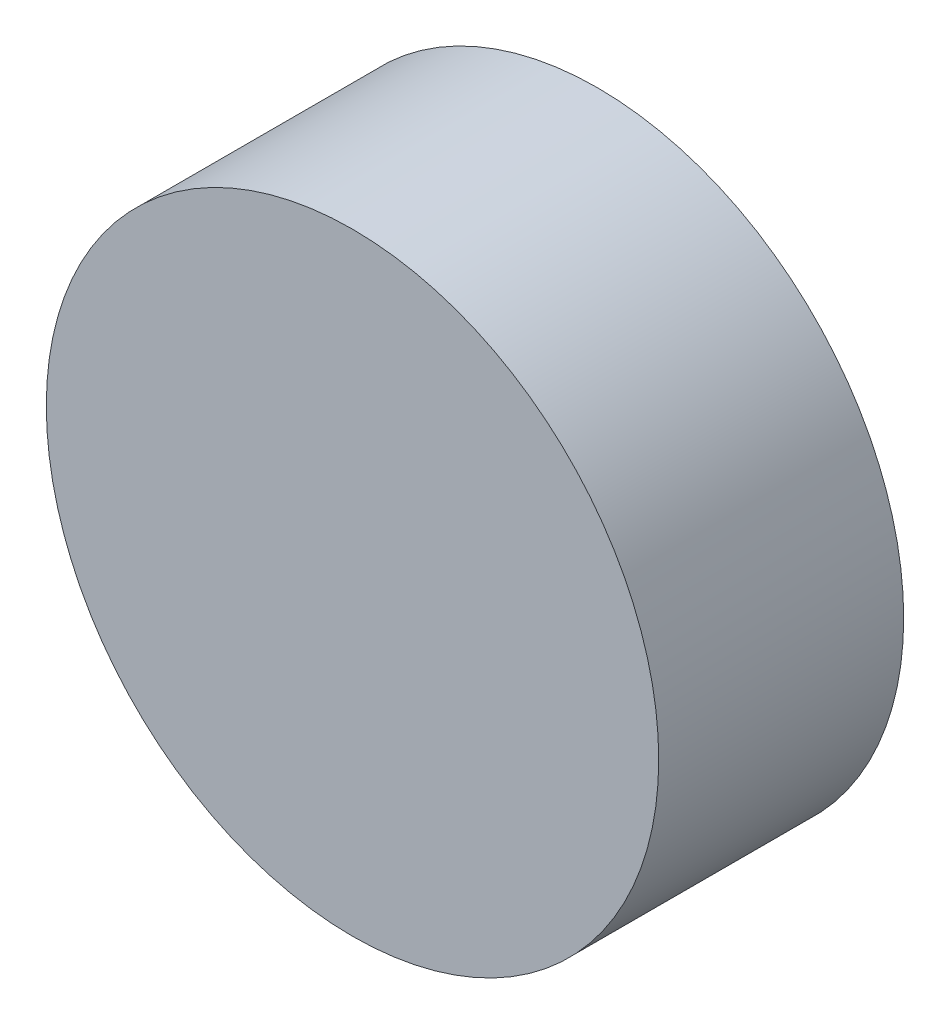
ISO-10303-21;
HEADER;
FILE_DESCRIPTION(('STEP AP214'),'2;1');
FILE_NAME('part.step','',(''),(''),'','','');
FILE_SCHEMA(('AUTOMOTIVE_DESIGN { 1 0 10303 214 1 1 1 1 }'));
ENDSEC;
DATA;
#1=APPLICATION_CONTEXT('core data for automotive mechanical design processes');
#2=APPLICATION_PROTOCOL_DEFINITION('international standard','automotive_design',2000,#1);
#3=PRODUCT_CONTEXT('',#1,'mechanical');
#4=PRODUCT('Part','Part','',(#3));
#5=PRODUCT_RELATED_PRODUCT_CATEGORY('part','',(#4));
#6=PRODUCT_DEFINITION_FORMATION('','',#4);
#7=PRODUCT_DEFINITION_CONTEXT('part definition',#1,'design');
#8=PRODUCT_DEFINITION('design','',#6,#7);
#9=PRODUCT_DEFINITION_SHAPE('','',#8);
#10=(LENGTH_UNIT() NAMED_UNIT(*) SI_UNIT(.MILLI.,.METRE.));
#11=(NAMED_UNIT(*) PLANE_ANGLE_UNIT() SI_UNIT($,.RADIAN.));
#12=(NAMED_UNIT(*) SI_UNIT($,.STERADIAN.) SOLID_ANGLE_UNIT());
#13=UNCERTAINTY_MEASURE_WITH_UNIT(LENGTH_MEASURE(1.E-05),#10,'distance_accuracy_value','');
#14=(GEOMETRIC_REPRESENTATION_CONTEXT(3) GLOBAL_UNCERTAINTY_ASSIGNED_CONTEXT((#13)) GLOBAL_UNIT_ASSIGNED_CONTEXT((#10,
#11,#12)) REPRESENTATION_CONTEXT('',''));
#15=CARTESIAN_POINT('',(0.,0.,0.));
#16=DIRECTION('',(0.,0.,1.));
#17=DIRECTION('',(1.,0.,0.));
#18=AXIS2_PLACEMENT_3D('',#15,#16,#17);
#19=CARTESIAN_POINT('',(0.,0.,1.));
#20=DIRECTION('',(0.,0.,-1.));
#21=DIRECTION('',(-1.,0.,0.));
#22=AXIS2_PLACEMENT_3D('',#19,#20,#21);
#23=CYLINDRICAL_SURFACE('',#22,2.5);
#24=CARTESIAN_POINT('',(0.,0.,1.));
#25=DIRECTION('',(0.,0.,1.));
#26=DIRECTION('',(1.,0.,0.));
#27=AXIS2_PLACEMENT_3D('',#24,#25,#26);
#28=CIRCLE('',#27,2.5);
#29=CARTESIAN_POINT('',(2.5,0.,1.));
#30=VERTEX_POINT('',#29);
#31=EDGE_CURVE('E10',#30,#30,#28,.T.);
#32=ORIENTED_EDGE('',*,*,#31,.F.);
#33=EDGE_LOOP('',(#32));
#34=FACE_BOUND('',#33,.T.);
#35=CARTESIAN_POINT('',(0.,0.,-1.));
#36=DIRECTION('',(0.,0.,1.));
#37=DIRECTION('',(1.,0.,0.));
#38=AXIS2_PLACEMENT_3D('',#35,#36,#37);
#39=CIRCLE('',#38,2.5);
#40=CARTESIAN_POINT('',(2.5,0.,-1.));
#41=VERTEX_POINT('',#40);
#42=EDGE_CURVE('E40',#41,#41,#39,.T.);
#43=ORIENTED_EDGE('',*,*,#42,.T.);
#44=EDGE_LOOP('',(#43));
#45=FACE_BOUND('',#44,.T.);
#46=ADVANCED_FACE('F37',(#34,#45),#23,.T.);
#47=CARTESIAN_POINT('',(0.,0.,1.));
#48=DIRECTION('',(0.,0.,1.));
#49=DIRECTION('',(1.,0.,0.));
#50=AXIS2_PLACEMENT_3D('',#47,#48,#49);
#51=PLANE('',#50);
#52=ORIENTED_EDGE('',*,*,#31,.T.);
#53=EDGE_LOOP('',(#52));
#54=FACE_BOUND('',#53,.T.);
#55=ADVANCED_FACE('F54',(#54),#51,.T.);
#56=CARTESIAN_POINT('',(0.,0.,-1.));
#57=DIRECTION('',(0.,0.,1.));
#58=DIRECTION('',(1.,0.,0.));
#59=AXIS2_PLACEMENT_3D('',#56,#57,#58);
#60=PLANE('',#59);
#61=ORIENTED_EDGE('',*,*,#42,.F.);
#62=EDGE_LOOP('',(#61));
#63=FACE_BOUND('',#62,.T.);
#64=ADVANCED_FACE('F52',(#63),#60,.F.);
#65=CLOSED_SHELL('',(#46,#55,#64));
#66=MANIFOLD_SOLID_BREP('B2',#65);
#67=ADVANCED_BREP_SHAPE_REPRESENTATION('',(#18,#66),#14);
#68=SHAPE_DEFINITION_REPRESENTATION(#9,#67);
ENDSEC;
END-ISO-10303-21;
